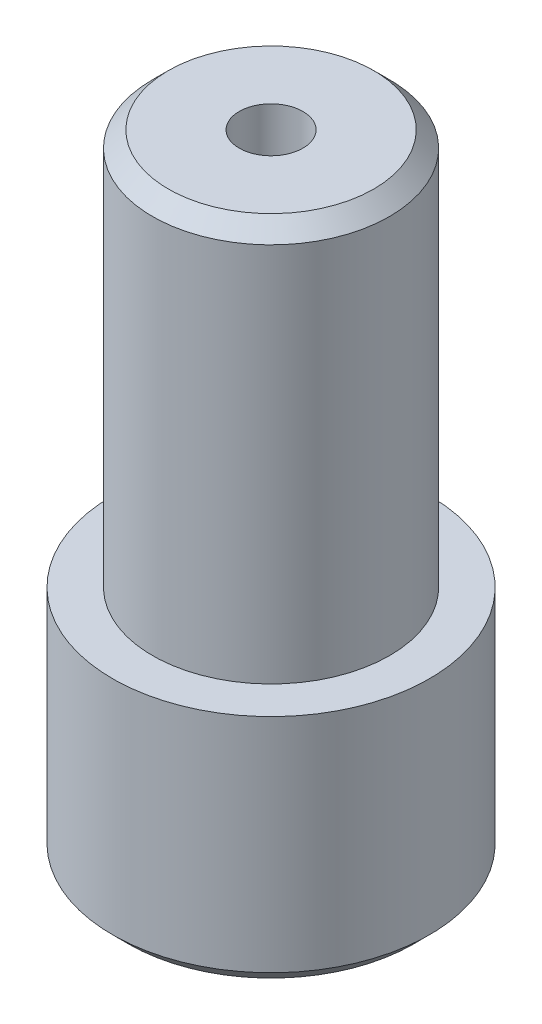
ISO-10303-21;
HEADER;
FILE_DESCRIPTION(('STEP AP214'),'2;1');
FILE_NAME('part.step','',(''),(''),'','','');
FILE_SCHEMA(('AUTOMOTIVE_DESIGN { 1 0 10303 214 1 1 1 1 }'));
ENDSEC;
DATA;
#1=APPLICATION_CONTEXT('core data for automotive mechanical design processes');
#2=APPLICATION_PROTOCOL_DEFINITION('international standard','automotive_design',2000,#1);
#3=PRODUCT_CONTEXT('',#1,'mechanical');
#4=PRODUCT('Part','Part','',(#3));
#5=PRODUCT_RELATED_PRODUCT_CATEGORY('part','',(#4));
#6=PRODUCT_DEFINITION_FORMATION('','',#4);
#7=PRODUCT_DEFINITION_CONTEXT('part definition',#1,'design');
#8=PRODUCT_DEFINITION('design','',#6,#7);
#9=PRODUCT_DEFINITION_SHAPE('','',#8);
#10=(LENGTH_UNIT() NAMED_UNIT(*) SI_UNIT(.MILLI.,.METRE.));
#11=(NAMED_UNIT(*) PLANE_ANGLE_UNIT() SI_UNIT($,.RADIAN.));
#12=(NAMED_UNIT(*) SI_UNIT($,.STERADIAN.) SOLID_ANGLE_UNIT());
#13=UNCERTAINTY_MEASURE_WITH_UNIT(LENGTH_MEASURE(1.E-05),#10,'distance_accuracy_value','');
#14=(GEOMETRIC_REPRESENTATION_CONTEXT(3) GLOBAL_UNCERTAINTY_ASSIGNED_CONTEXT((#13)) GLOBAL_UNIT_ASSIGNED_CONTEXT((#10,
#11,#12)) REPRESENTATION_CONTEXT('',''));
#15=CARTESIAN_POINT('',(0.,0.,0.));
#16=DIRECTION('',(0.,0.,1.));
#17=DIRECTION('',(1.,0.,0.));
#18=AXIS2_PLACEMENT_3D('',#15,#16,#17);
#19=CARTESIAN_POINT('',(0.,0.,0.));
#20=DIRECTION('',(0.,1.,0.));
#21=DIRECTION('',(-1.,0.,0.));
#22=AXIS2_PLACEMENT_3D('',#19,#20,#21);
#23=PLANE('',#22);
#24=CARTESIAN_POINT('',(0.,0.,0.));
#25=DIRECTION('',(0.,1.,0.));
#26=DIRECTION('',(-1.,0.,0.));
#27=AXIS2_PLACEMENT_3D('',#24,#25,#26);
#28=CIRCLE('',#27,11.43);
#29=CARTESIAN_POINT('',(-11.43,0.,0.));
#30=VERTEX_POINT('',#29);
#31=EDGE_CURVE('E70',#30,#30,#28,.F.);
#32=ORIENTED_EDGE('',*,*,#31,.T.);
#33=EDGE_LOOP('',(#32));
#34=FACE_BOUND('',#33,.T.);
#35=ADVANCED_FACE('F37',(#34),#23,.F.);
#36=CARTESIAN_POINT('',(0.,50.8,0.));
#37=DIRECTION('',(0.,1.,0.));
#38=DIRECTION('',(-1.,0.,0.));
#39=AXIS2_PLACEMENT_3D('',#36,#37,#38);
#40=CYLINDRICAL_SURFACE('',#39,12.7);
#41=CARTESIAN_POINT('',(0.,1.27,0.));
#42=DIRECTION('',(0.,1.,0.));
#43=DIRECTION('',(-1.,0.,0.));
#44=AXIS2_PLACEMENT_3D('',#41,#42,#43);
#45=CIRCLE('',#44,12.7);
#46=CARTESIAN_POINT('',(-12.7,1.27,0.));
#47=VERTEX_POINT('',#46);
#48=EDGE_CURVE('E67',#47,#47,#45,.T.);
#49=ORIENTED_EDGE('',*,*,#48,.T.);
#50=EDGE_LOOP('',(#49));
#51=FACE_BOUND('',#50,.T.);
#52=CARTESIAN_POINT('',(0.,19.05,0.));
#53=DIRECTION('',(0.,1.,0.));
#54=DIRECTION('',(-1.,0.,0.));
#55=AXIS2_PLACEMENT_3D('',#52,#53,#54);
#56=CIRCLE('',#55,12.7);
#57=CARTESIAN_POINT('',(-12.7,19.05,0.));
#58=VERTEX_POINT('',#57);
#59=EDGE_CURVE('E60',#58,#58,#56,.T.);
#60=ORIENTED_EDGE('',*,*,#59,.F.);
#61=EDGE_LOOP('',(#60));
#62=FACE_BOUND('',#61,.T.);
#63=ADVANCED_FACE('F86',(#51,#62),#40,.T.);
#64=CARTESIAN_POINT('',(12.7,19.05,0.));
#65=DIRECTION('',(0.,-1.,0.));
#66=DIRECTION('',(1.,0.,0.));
#67=AXIS2_PLACEMENT_3D('',#64,#65,#66);
#68=PLANE('',#67);
#69=CARTESIAN_POINT('',(0.,19.05,0.));
#70=DIRECTION('',(0.,1.,0.));
#71=DIRECTION('',(-1.,0.,0.));
#72=AXIS2_PLACEMENT_3D('',#69,#70,#71);
#73=CIRCLE('',#72,9.4996);
#74=CARTESIAN_POINT('',(-9.4996,19.05,0.));
#75=VERTEX_POINT('',#74);
#76=EDGE_CURVE('E56',#75,#75,#73,.T.);
#77=ORIENTED_EDGE('',*,*,#76,.F.);
#78=EDGE_LOOP('',(#77));
#79=FACE_BOUND('',#78,.T.);
#80=ORIENTED_EDGE('',*,*,#59,.T.);
#81=EDGE_LOOP('',(#80));
#82=FACE_BOUND('',#81,.T.);
#83=ADVANCED_FACE('F92',(#79,#82),#68,.F.);
#84=CARTESIAN_POINT('',(0.,50.8,0.));
#85=DIRECTION('',(0.,1.,0.));
#86=DIRECTION('',(-1.,0.,0.));
#87=AXIS2_PLACEMENT_3D('',#84,#85,#86);
#88=CYLINDRICAL_SURFACE('',#87,9.4996);
#89=CARTESIAN_POINT('',(0.,49.53,0.));
#90=DIRECTION('',(0.,-1.,0.));
#91=DIRECTION('',(1.,0.,0.));
#92=AXIS2_PLACEMENT_3D('',#89,#90,#91);
#93=CIRCLE('',#92,9.4996);
#94=CARTESIAN_POINT('',(9.4996,49.53,0.));
#95=VERTEX_POINT('',#94);
#96=EDGE_CURVE('E11',#95,#95,#93,.T.);
#97=ORIENTED_EDGE('',*,*,#96,.T.);
#98=EDGE_LOOP('',(#97));
#99=FACE_BOUND('',#98,.T.);
#100=ORIENTED_EDGE('',*,*,#76,.T.);
#101=EDGE_LOOP('',(#100));
#102=FACE_BOUND('',#101,.T.);
#103=ADVANCED_FACE('F98',(#99,#102),#88,.T.);
#104=CARTESIAN_POINT('',(9.4996,50.8,0.));
#105=DIRECTION('',(0.,-1.,0.));
#106=DIRECTION('',(1.,0.,0.));
#107=AXIS2_PLACEMENT_3D('',#104,#105,#106);
#108=PLANE('',#107);
#109=CARTESIAN_POINT('',(0.,50.8,0.));
#110=DIRECTION('',(0.,1.,0.));
#111=DIRECTION('',(0.,0.,1.));
#112=AXIS2_PLACEMENT_3D('',#109,#110,#111);
#113=CIRCLE('',#112,2.55269999999999);
#114=CARTESIAN_POINT('',(0.,50.8,2.55269999999999));
#115=VERTEX_POINT('',#114);
#116=EDGE_CURVE('E57',#115,#115,#113,.T.);
#117=ORIENTED_EDGE('',*,*,#116,.F.);
#118=EDGE_LOOP('',(#117));
#119=FACE_BOUND('',#118,.T.);
#120=CARTESIAN_POINT('',(0.,50.8,0.));
#121=DIRECTION('',(0.,-1.,0.));
#122=DIRECTION('',(1.,0.,0.));
#123=AXIS2_PLACEMENT_3D('',#120,#121,#122);
#124=CIRCLE('',#123,8.2296);
#125=CARTESIAN_POINT('',(8.22959999999999,50.8,0.));
#126=VERTEX_POINT('',#125);
#127=EDGE_CURVE('E44',#126,#126,#124,.F.);
#128=ORIENTED_EDGE('',*,*,#127,.T.);
#129=EDGE_LOOP('',(#128));
#130=FACE_BOUND('',#129,.T.);
#131=ADVANCED_FACE('F75',(#119,#130),#108,.F.);
#132=CARTESIAN_POINT('',(0.,1.27,0.));
#133=DIRECTION('',(0.,1.,0.));
#134=DIRECTION('',(-1.,0.,0.));
#135=AXIS2_PLACEMENT_3D('',#132,#133,#134);
#136=CONICAL_SURFACE('',#135,12.7,0.785398163397449);
#137=ORIENTED_EDGE('',*,*,#31,.F.);
#138=EDGE_LOOP('',(#137));
#139=FACE_BOUND('',#138,.T.);
#140=ORIENTED_EDGE('',*,*,#48,.F.);
#141=EDGE_LOOP('',(#140));
#142=FACE_BOUND('',#141,.T.);
#143=ADVANCED_FACE('F78',(#139,#142),#136,.T.);
#144=CARTESIAN_POINT('',(0.,50.8,0.));
#145=DIRECTION('',(0.,-1.,0.));
#146=DIRECTION('',(1.,0.,0.));
#147=AXIS2_PLACEMENT_3D('',#144,#145,#146);
#148=CONICAL_SURFACE('',#147,8.2296,0.785398163397444);
#149=ORIENTED_EDGE('',*,*,#96,.F.);
#150=EDGE_LOOP('',(#149));
#151=FACE_BOUND('',#150,.T.);
#152=ORIENTED_EDGE('',*,*,#127,.F.);
#153=EDGE_LOOP('',(#152));
#154=FACE_BOUND('',#153,.T.);
#155=ADVANCED_FACE('F39',(#151,#154),#148,.T.);
#156=CARTESIAN_POINT('',(0.,34.29,0.));
#157=DIRECTION('',(0.,1.,0.));
#158=DIRECTION('',(0.,0.,1.));
#159=AXIS2_PLACEMENT_3D('',#156,#157,#158);
#160=CONICAL_SURFACE('',#159,2.55269999999999,1.02974425867665);
#161=CARTESIAN_POINT('',(0.,32.7561830978084,0.));
#162=VERTEX_POINT('',#161);
#163=VERTEX_LOOP('',#162);
#164=FACE_BOUND('',#163,.T.);
#165=CARTESIAN_POINT('',(0.,34.29,0.));
#166=DIRECTION('',(0.,1.,0.));
#167=DIRECTION('',(0.,0.,1.));
#168=AXIS2_PLACEMENT_3D('',#165,#166,#167);
#169=CIRCLE('',#168,2.55269999999999);
#170=CARTESIAN_POINT('',(0.,34.29,2.55269999999999));
#171=VERTEX_POINT('',#170);
#172=EDGE_CURVE('E54',#171,#171,#169,.T.);
#173=ORIENTED_EDGE('',*,*,#172,.T.);
#174=EDGE_LOOP('',(#173));
#175=FACE_BOUND('',#174,.T.);
#176=ADVANCED_FACE('F47',(#164,#175),#160,.F.);
#177=CARTESIAN_POINT('',(0.,50.8,0.));
#178=DIRECTION('',(0.,1.,0.));
#179=DIRECTION('',(0.,0.,1.));
#180=AXIS2_PLACEMENT_3D('',#177,#178,#179);
#181=CYLINDRICAL_SURFACE('',#180,2.55269999999999);
#182=ORIENTED_EDGE('',*,*,#172,.F.);
#183=EDGE_LOOP('',(#182));
#184=FACE_BOUND('',#183,.T.);
#185=ORIENTED_EDGE('',*,*,#116,.T.);
#186=EDGE_LOOP('',(#185));
#187=FACE_BOUND('',#186,.T.);
#188=ADVANCED_FACE('F50',(#184,#187),#181,.F.);
#189=CLOSED_SHELL('',(#35,#63,#83,#103,#131,#143,#155,#176,#188));
#190=MANIFOLD_SOLID_BREP('B2',#189);
#191=ADVANCED_BREP_SHAPE_REPRESENTATION('',(#18,#190),#14);
#192=SHAPE_DEFINITION_REPRESENTATION(#9,#191);
ENDSEC;
END-ISO-10303-21;
